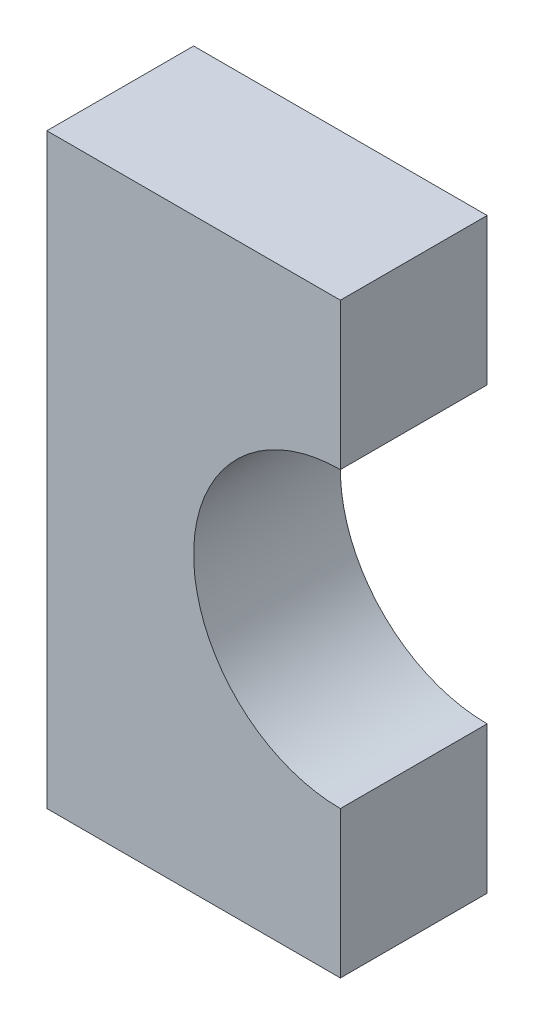
ISO-10303-21;
HEADER;
FILE_DESCRIPTION(('STEP AP214'),'2;1');
FILE_NAME('part.step','',(''),(''),'','','');
FILE_SCHEMA(('AUTOMOTIVE_DESIGN { 1 0 10303 214 1 1 1 1 }'));
ENDSEC;
DATA;
#1=APPLICATION_CONTEXT('core data for automotive mechanical design processes');
#2=APPLICATION_PROTOCOL_DEFINITION('international standard','automotive_design',2000,#1);
#3=PRODUCT_CONTEXT('',#1,'mechanical');
#4=PRODUCT('Part','Part','',(#3));
#5=PRODUCT_RELATED_PRODUCT_CATEGORY('part','',(#4));
#6=PRODUCT_DEFINITION_FORMATION('','',#4);
#7=PRODUCT_DEFINITION_CONTEXT('part definition',#1,'design');
#8=PRODUCT_DEFINITION('design','',#6,#7);
#9=PRODUCT_DEFINITION_SHAPE('','',#8);
#10=(LENGTH_UNIT() NAMED_UNIT(*) SI_UNIT(.MILLI.,.METRE.));
#11=(NAMED_UNIT(*) PLANE_ANGLE_UNIT() SI_UNIT($,.RADIAN.));
#12=(NAMED_UNIT(*) SI_UNIT($,.STERADIAN.) SOLID_ANGLE_UNIT());
#13=UNCERTAINTY_MEASURE_WITH_UNIT(LENGTH_MEASURE(1.E-05),#10,'distance_accuracy_value','');
#14=(GEOMETRIC_REPRESENTATION_CONTEXT(3) GLOBAL_UNCERTAINTY_ASSIGNED_CONTEXT((#13)) GLOBAL_UNIT_ASSIGNED_CONTEXT((#10,
#11,#12)) REPRESENTATION_CONTEXT('',''));
#15=CARTESIAN_POINT('',(0.,0.,0.));
#16=DIRECTION('',(0.,0.,1.));
#17=DIRECTION('',(1.,0.,0.));
#18=AXIS2_PLACEMENT_3D('',#15,#16,#17);
#19=CARTESIAN_POINT('',(0.400000000000009,0.400000000000001,0.2));
#20=DIRECTION('',(0.,0.,1.));
#21=DIRECTION('',(1.,0.,0.));
#22=AXIS2_PLACEMENT_3D('',#19,#20,#21);
#23=PLANE('',#22);
#24=DIRECTION('',(1.,0.,0.));
#25=VECTOR('',#24,1.);
#26=CARTESIAN_POINT('',(0.8,-0.399999999999998,0.2));
#27=LINE('',#26,#25);
#28=CARTESIAN_POINT('',(0.8,-0.399999999999998,0.2));
#29=VERTEX_POINT('',#28);
#30=CARTESIAN_POINT('',(0.400000000000008,-0.399999999999998,0.2));
#31=VERTEX_POINT('',#30);
#32=EDGE_CURVE('E115',#29,#31,#27,.F.);
#33=ORIENTED_EDGE('',*,*,#32,.F.);
#34=DIRECTION('',(0.,1.,0.));
#35=VECTOR('',#34,1.);
#36=CARTESIAN_POINT('',(0.800000000000002,0.400000000000001,0.2));
#37=LINE('',#36,#35);
#38=CARTESIAN_POINT('',(0.800000000000007,-0.200000000000037,0.2));
#39=VERTEX_POINT('',#38);
#40=EDGE_CURVE('E52',#39,#29,#37,.F.);
#41=ORIENTED_EDGE('',*,*,#40,.F.);
#42=CARTESIAN_POINT('',(0.800000000000002,0.,0.2));
#43=DIRECTION('',(0.,0.,1.));
#44=DIRECTION('',(1.,0.,0.));
#45=AXIS2_PLACEMENT_3D('',#42,#43,#44);
#46=CIRCLE('',#45,0.2);
#47=CARTESIAN_POINT('',(0.8,0.199999999999999,0.2));
#48=VERTEX_POINT('',#47);
#49=EDGE_CURVE('E20',#39,#48,#46,.F.);
#50=ORIENTED_EDGE('',*,*,#49,.T.);
#51=DIRECTION('',(0.,1.,0.));
#52=VECTOR('',#51,1.);
#53=CARTESIAN_POINT('',(0.800000000000002,0.400000000000001,0.2));
#54=LINE('',#53,#52);
#55=CARTESIAN_POINT('',(0.800000000000002,0.400000000000001,0.2));
#56=VERTEX_POINT('',#55);
#57=EDGE_CURVE('E80',#56,#48,#54,.F.);
#58=ORIENTED_EDGE('',*,*,#57,.F.);
#59=DIRECTION('',(1.,0.,0.));
#60=VECTOR('',#59,1.);
#61=CARTESIAN_POINT('',(0.400000000000009,0.400000000000001,0.2));
#62=LINE('',#61,#60);
#63=CARTESIAN_POINT('',(0.400000000000009,0.400000000000001,0.2));
#64=VERTEX_POINT('',#63);
#65=EDGE_CURVE('E77',#64,#56,#62,.T.);
#66=ORIENTED_EDGE('',*,*,#65,.F.);
#67=DIRECTION('',(0.,1.,0.));
#68=VECTOR('',#67,1.);
#69=CARTESIAN_POINT('',(0.400000000000008,-0.399999999999998,0.2));
#70=LINE('',#69,#68);
#71=EDGE_CURVE('E116',#31,#64,#70,.T.);
#72=ORIENTED_EDGE('',*,*,#71,.F.);
#73=EDGE_LOOP('',(#33,#41,#50,#58,#66,#72));
#74=FACE_BOUND('',#73,.T.);
#75=ADVANCED_FACE('F17',(#74),#23,.T.);
#76=CARTESIAN_POINT('',(0.800000000000002,0.400000000000001,0.));
#77=DIRECTION('',(1.,0.,0.));
#78=DIRECTION('',(0.,0.,-1.));
#79=AXIS2_PLACEMENT_3D('',#76,#77,#78);
#80=PLANE('',#79);
#81=DIRECTION('',(0.,1.,0.));
#82=VECTOR('',#81,1.);
#83=CARTESIAN_POINT('',(0.800000000000002,0.400000000000001,0.));
#84=LINE('',#83,#82);
#85=CARTESIAN_POINT('',(0.8,0.199999999999999,0.));
#86=VERTEX_POINT('',#85);
#87=CARTESIAN_POINT('',(0.800000000000002,0.400000000000001,0.));
#88=VERTEX_POINT('',#87);
#89=EDGE_CURVE('E86',#86,#88,#84,.T.);
#90=ORIENTED_EDGE('',*,*,#89,.T.);
#91=DIRECTION('',(0.,0.,1.));
#92=VECTOR('',#91,1.);
#93=CARTESIAN_POINT('',(0.800000000000002,0.400000000000001,0.));
#94=LINE('',#93,#92);
#95=EDGE_CURVE('E72',#56,#88,#94,.F.);
#96=ORIENTED_EDGE('',*,*,#95,.F.);
#97=ORIENTED_EDGE('',*,*,#57,.T.);
#98=DIRECTION('',(0.,0.,1.));
#99=VECTOR('',#98,1.);
#100=CARTESIAN_POINT('',(0.8,0.199999999999999,0.2));
#101=LINE('',#100,#99);
#102=EDGE_CURVE('E94',#48,#86,#101,.F.);
#103=ORIENTED_EDGE('',*,*,#102,.T.);
#104=EDGE_LOOP('',(#90,#96,#97,#103));
#105=FACE_BOUND('',#104,.T.);
#106=ADVANCED_FACE('F92',(#105),#80,.T.);
#107=CARTESIAN_POINT('',(0.400000000000009,0.400000000000001,0.));
#108=DIRECTION('',(0.,1.,0.));
#109=DIRECTION('',(0.,0.,1.));
#110=AXIS2_PLACEMENT_3D('',#107,#108,#109);
#111=PLANE('',#110);
#112=DIRECTION('',(0.,0.,1.));
#113=VECTOR('',#112,1.);
#114=CARTESIAN_POINT('',(0.400000000000009,0.400000000000001,0.));
#115=LINE('',#114,#113);
#116=CARTESIAN_POINT('',(0.400000000000009,0.400000000000001,0.));
#117=VERTEX_POINT('',#116);
#118=EDGE_CURVE('E122',#64,#117,#115,.F.);
#119=ORIENTED_EDGE('',*,*,#118,.F.);
#120=ORIENTED_EDGE('',*,*,#65,.T.);
#121=ORIENTED_EDGE('',*,*,#95,.T.);
#122=DIRECTION('',(1.,0.,0.));
#123=VECTOR('',#122,1.);
#124=CARTESIAN_POINT('',(0.400000000000009,0.400000000000001,0.));
#125=LINE('',#124,#123);
#126=EDGE_CURVE('E76',#88,#117,#125,.F.);
#127=ORIENTED_EDGE('',*,*,#126,.T.);
#128=EDGE_LOOP('',(#119,#120,#121,#127));
#129=FACE_BOUND('',#128,.T.);
#130=ADVANCED_FACE('F75',(#129),#111,.T.);
#131=CARTESIAN_POINT('',(0.400000000000008,-0.399999999999998,0.));
#132=DIRECTION('',(-1.,0.,0.));
#133=DIRECTION('',(0.,0.,1.));
#134=AXIS2_PLACEMENT_3D('',#131,#132,#133);
#135=PLANE('',#134);
#136=DIRECTION('',(0.,0.,-1.));
#137=VECTOR('',#136,1.);
#138=CARTESIAN_POINT('',(0.400000000000008,-0.399999999999998,0.));
#139=LINE('',#138,#137);
#140=CARTESIAN_POINT('',(0.400000000000008,-0.399999999999998,0.));
#141=VERTEX_POINT('',#140);
#142=EDGE_CURVE('E113',#31,#141,#139,.T.);
#143=ORIENTED_EDGE('',*,*,#142,.F.);
#144=ORIENTED_EDGE('',*,*,#71,.T.);
#145=ORIENTED_EDGE('',*,*,#118,.T.);
#146=DIRECTION('',(0.,1.,0.));
#147=VECTOR('',#146,1.);
#148=CARTESIAN_POINT('',(0.400000000000009,0.400000000000001,0.));
#149=LINE('',#148,#147);
#150=EDGE_CURVE('E90',#117,#141,#149,.F.);
#151=ORIENTED_EDGE('',*,*,#150,.T.);
#152=EDGE_LOOP('',(#143,#144,#145,#151));
#153=FACE_BOUND('',#152,.T.);
#154=ADVANCED_FACE('F148',(#153),#135,.T.);
#155=CARTESIAN_POINT('',(0.8,-0.399999999999998,0.));
#156=DIRECTION('',(0.,-1.,0.));
#157=DIRECTION('',(0.,0.,-1.));
#158=AXIS2_PLACEMENT_3D('',#155,#156,#157);
#159=PLANE('',#158);
#160=DIRECTION('',(0.,0.,-1.));
#161=VECTOR('',#160,1.);
#162=CARTESIAN_POINT('',(0.8,-0.399999999999998,0.));
#163=LINE('',#162,#161);
#164=CARTESIAN_POINT('',(0.8,-0.399999999999998,0.));
#165=VERTEX_POINT('',#164);
#166=EDGE_CURVE('E104',#29,#165,#163,.T.);
#167=ORIENTED_EDGE('',*,*,#166,.F.);
#168=ORIENTED_EDGE('',*,*,#32,.T.);
#169=ORIENTED_EDGE('',*,*,#142,.T.);
#170=DIRECTION('',(1.,0.,0.));
#171=VECTOR('',#170,1.);
#172=CARTESIAN_POINT('',(0.400000000000008,-0.399999999999998,0.));
#173=LINE('',#172,#171);
#174=EDGE_CURVE('E108',#141,#165,#173,.T.);
#175=ORIENTED_EDGE('',*,*,#174,.T.);
#176=EDGE_LOOP('',(#167,#168,#169,#175));
#177=FACE_BOUND('',#176,.T.);
#178=ADVANCED_FACE('F152',(#177),#159,.T.);
#179=CARTESIAN_POINT('',(0.800000000000002,0.400000000000001,0.));
#180=DIRECTION('',(1.,0.,0.));
#181=DIRECTION('',(0.,0.,-1.));
#182=AXIS2_PLACEMENT_3D('',#179,#180,#181);
#183=PLANE('',#182);
#184=DIRECTION('',(0.,1.,0.));
#185=VECTOR('',#184,1.);
#186=CARTESIAN_POINT('',(0.800000000000002,0.400000000000001,0.));
#187=LINE('',#186,#185);
#188=CARTESIAN_POINT('',(0.800000000000007,-0.200000000000037,0.));
#189=VERTEX_POINT('',#188);
#190=EDGE_CURVE('E26',#165,#189,#187,.T.);
#191=ORIENTED_EDGE('',*,*,#190,.T.);
#192=DIRECTION('',(0.,0.,1.));
#193=VECTOR('',#192,1.);
#194=CARTESIAN_POINT('',(0.800000000000007,-0.200000000000037,0.2));
#195=LINE('',#194,#193);
#196=EDGE_CURVE('E33',#189,#39,#195,.T.);
#197=ORIENTED_EDGE('',*,*,#196,.T.);
#198=ORIENTED_EDGE('',*,*,#40,.T.);
#199=ORIENTED_EDGE('',*,*,#166,.T.);
#200=EDGE_LOOP('',(#191,#197,#198,#199));
#201=FACE_BOUND('',#200,.T.);
#202=ADVANCED_FACE('F154',(#201),#183,.T.);
#203=CARTESIAN_POINT('',(0.800000000000002,0.,0.2));
#204=DIRECTION('',(0.,0.,1.));
#205=DIRECTION('',(1.,0.,0.));
#206=AXIS2_PLACEMENT_3D('',#203,#204,#205);
#207=CYLINDRICAL_SURFACE('',#206,0.2);
#208=ORIENTED_EDGE('',*,*,#102,.F.);
#209=ORIENTED_EDGE('',*,*,#49,.F.);
#210=ORIENTED_EDGE('',*,*,#196,.F.);
#211=CARTESIAN_POINT('',(0.800000000000002,0.,0.));
#212=DIRECTION('',(0.,0.,1.));
#213=DIRECTION('',(1.,0.,0.));
#214=AXIS2_PLACEMENT_3D('',#211,#212,#213);
#215=CIRCLE('',#214,0.2);
#216=EDGE_CURVE('E11',#189,#86,#215,.F.);
#217=ORIENTED_EDGE('',*,*,#216,.T.);
#218=EDGE_LOOP('',(#208,#209,#210,#217));
#219=FACE_BOUND('',#218,.T.);
#220=ADVANCED_FACE('F155',(#219),#207,.F.);
#221=CARTESIAN_POINT('',(0.400000000000009,0.400000000000001,0.));
#222=DIRECTION('',(0.,0.,1.));
#223=DIRECTION('',(1.,0.,0.));
#224=AXIS2_PLACEMENT_3D('',#221,#222,#223);
#225=PLANE('',#224);
#226=ORIENTED_EDGE('',*,*,#190,.F.);
#227=ORIENTED_EDGE('',*,*,#174,.F.);
#228=ORIENTED_EDGE('',*,*,#150,.F.);
#229=ORIENTED_EDGE('',*,*,#126,.F.);
#230=ORIENTED_EDGE('',*,*,#89,.F.);
#231=ORIENTED_EDGE('',*,*,#216,.F.);
#232=EDGE_LOOP('',(#226,#227,#228,#229,#230,#231));
#233=FACE_BOUND('',#232,.T.);
#234=ADVANCED_FACE('F85',(#233),#225,.F.);
#235=CLOSED_SHELL('',(#75,#106,#130,#154,#178,#202,#220,#234));
#236=MANIFOLD_SOLID_BREP('B1',#235);
#237=ADVANCED_BREP_SHAPE_REPRESENTATION('',(#18,#236),#14);
#238=SHAPE_DEFINITION_REPRESENTATION(#9,#237);
ENDSEC;
END-ISO-10303-21;
